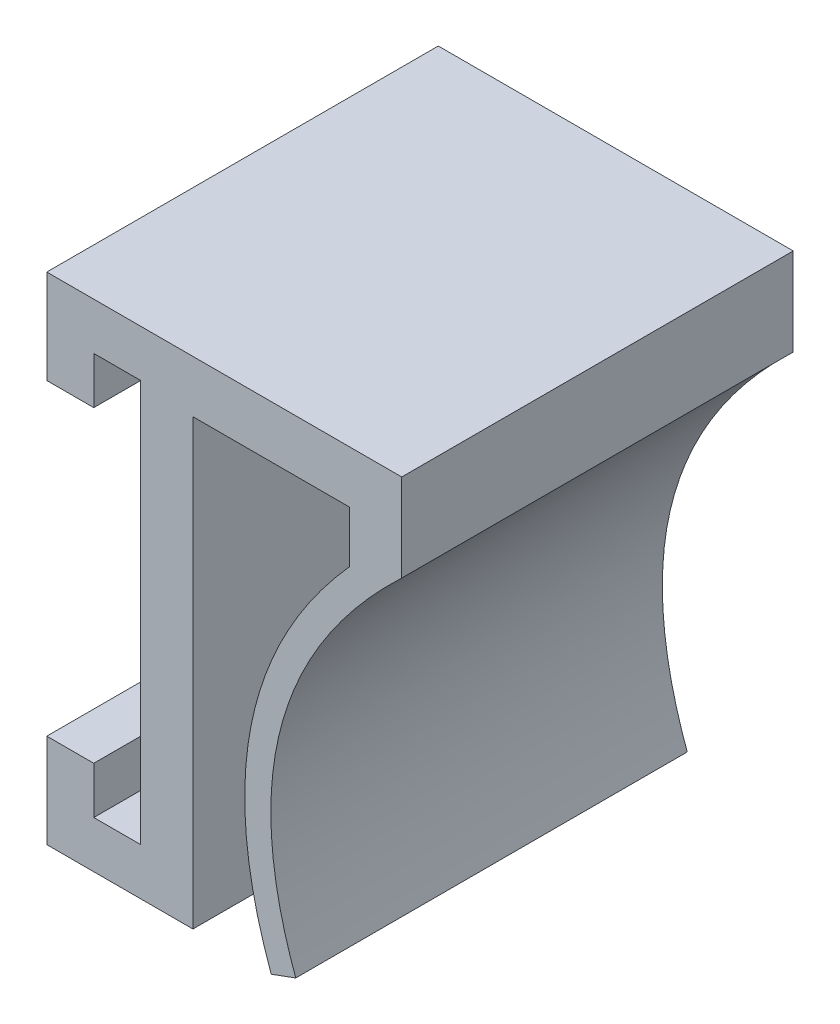
ISO-10303-21;
HEADER;
FILE_DESCRIPTION(('STEP AP214'),'2;1');
FILE_NAME('part.step','',(''),(''),'','','');
FILE_SCHEMA(('AUTOMOTIVE_DESIGN { 1 0 10303 214 1 1 1 1 }'));
ENDSEC;
DATA;
#1=APPLICATION_CONTEXT('core data for automotive mechanical design processes');
#2=APPLICATION_PROTOCOL_DEFINITION('international standard','automotive_design',2000,#1);
#3=PRODUCT_CONTEXT('',#1,'mechanical');
#4=PRODUCT('Part','Part','',(#3));
#5=PRODUCT_RELATED_PRODUCT_CATEGORY('part','',(#4));
#6=PRODUCT_DEFINITION_FORMATION('','',#4);
#7=PRODUCT_DEFINITION_CONTEXT('part definition',#1,'design');
#8=PRODUCT_DEFINITION('design','',#6,#7);
#9=PRODUCT_DEFINITION_SHAPE('','',#8);
#10=(LENGTH_UNIT() NAMED_UNIT(*) SI_UNIT(.MILLI.,.METRE.));
#11=(NAMED_UNIT(*) PLANE_ANGLE_UNIT() SI_UNIT($,.RADIAN.));
#12=(NAMED_UNIT(*) SI_UNIT($,.STERADIAN.) SOLID_ANGLE_UNIT());
#13=UNCERTAINTY_MEASURE_WITH_UNIT(LENGTH_MEASURE(1.E-05),#10,'distance_accuracy_value','');
#14=(GEOMETRIC_REPRESENTATION_CONTEXT(3) GLOBAL_UNCERTAINTY_ASSIGNED_CONTEXT((#13)) GLOBAL_UNIT_ASSIGNED_CONTEXT((#10,
#11,#12)) REPRESENTATION_CONTEXT('',''));
#15=CARTESIAN_POINT('',(0.,0.,0.));
#16=DIRECTION('',(0.,0.,1.));
#17=DIRECTION('',(1.,0.,0.));
#18=AXIS2_PLACEMENT_3D('',#15,#16,#17);
#19=CARTESIAN_POINT('',(-4.6,7.7,0.));
#20=DIRECTION('',(0.,1.,0.));
#21=DIRECTION('',(0.,0.,1.));
#22=AXIS2_PLACEMENT_3D('',#19,#20,#21);
#23=PLANE('',#22);
#24=DIRECTION('',(0.,0.,1.));
#25=VECTOR('',#24,1.);
#26=CARTESIAN_POINT('',(-2.8,7.7,0.));
#27=LINE('',#26,#25);
#28=CARTESIAN_POINT('',(-2.8,7.7,0.));
#29=VERTEX_POINT('',#28);
#30=CARTESIAN_POINT('',(-2.8,7.7,15.));
#31=VERTEX_POINT('',#30);
#32=EDGE_CURVE('E191',#29,#31,#27,.T.);
#33=ORIENTED_EDGE('',*,*,#32,.F.);
#34=DIRECTION('',(1.,0.,0.));
#35=VECTOR('',#34,1.);
#36=CARTESIAN_POINT('',(-4.6,7.7,0.));
#37=LINE('',#36,#35);
#38=CARTESIAN_POINT('',(-1.,7.7,0.));
#39=VERTEX_POINT('',#38);
#40=EDGE_CURVE('E39',#29,#39,#37,.T.);
#41=ORIENTED_EDGE('',*,*,#40,.T.);
#42=DIRECTION('',(0.,0.,1.));
#43=VECTOR('',#42,1.);
#44=CARTESIAN_POINT('',(-1.,7.7,0.));
#45=LINE('',#44,#43);
#46=CARTESIAN_POINT('',(-1.,7.7,15.));
#47=VERTEX_POINT('',#46);
#48=EDGE_CURVE('E176',#39,#47,#45,.T.);
#49=ORIENTED_EDGE('',*,*,#48,.T.);
#50=DIRECTION('',(1.,0.,0.));
#51=VECTOR('',#50,1.);
#52=CARTESIAN_POINT('',(-4.6,7.7,15.));
#53=LINE('',#52,#51);
#54=EDGE_CURVE('E232',#31,#47,#53,.T.);
#55=ORIENTED_EDGE('',*,*,#54,.F.);
#56=EDGE_LOOP('',(#33,#41,#49,#55));
#57=FACE_BOUND('',#56,.T.);
#58=ADVANCED_FACE('F35',(#57),#23,.F.);
#59=CARTESIAN_POINT('',(-4.6,-7.7,15.));
#60=DIRECTION('',(0.,-1.,0.));
#61=DIRECTION('',(0.,0.,-1.));
#62=AXIS2_PLACEMENT_3D('',#59,#60,#61);
#63=PLANE('',#62);
#64=DIRECTION('',(0.,0.,-1.));
#65=VECTOR('',#64,1.);
#66=CARTESIAN_POINT('',(-2.8,-7.7,15.));
#67=LINE('',#66,#65);
#68=CARTESIAN_POINT('',(-2.8,-7.7,15.));
#69=VERTEX_POINT('',#68);
#70=CARTESIAN_POINT('',(-2.8,-7.7,0.));
#71=VERTEX_POINT('',#70);
#72=EDGE_CURVE('E201',#69,#71,#67,.T.);
#73=ORIENTED_EDGE('',*,*,#72,.F.);
#74=DIRECTION('',(1.,0.,0.));
#75=VECTOR('',#74,1.);
#76=CARTESIAN_POINT('',(-4.6,-7.7,15.));
#77=LINE('',#76,#75);
#78=CARTESIAN_POINT('',(-1.,-7.7,15.));
#79=VERTEX_POINT('',#78);
#80=EDGE_CURVE('E228',#69,#79,#77,.T.);
#81=ORIENTED_EDGE('',*,*,#80,.T.);
#82=DIRECTION('',(0.,0.,-1.));
#83=VECTOR('',#82,1.);
#84=CARTESIAN_POINT('',(-1.,-7.7,15.));
#85=LINE('',#84,#83);
#86=CARTESIAN_POINT('',(-1.,-7.7,0.));
#87=VERTEX_POINT('',#86);
#88=EDGE_CURVE('E217',#79,#87,#85,.T.);
#89=ORIENTED_EDGE('',*,*,#88,.T.);
#90=DIRECTION('',(1.,0.,0.));
#91=VECTOR('',#90,1.);
#92=CARTESIAN_POINT('',(-4.6,-7.7,0.));
#93=LINE('',#92,#91);
#94=EDGE_CURVE('E53',#71,#87,#93,.T.);
#95=ORIENTED_EDGE('',*,*,#94,.F.);
#96=EDGE_LOOP('',(#73,#81,#89,#95));
#97=FACE_BOUND('',#96,.T.);
#98=ADVANCED_FACE('F357',(#97),#63,.F.);
#99=CARTESIAN_POINT('',(-1.,0.,15.));
#100=DIRECTION('',(-1.,0.,0.));
#101=DIRECTION('',(0.,0.,1.));
#102=AXIS2_PLACEMENT_3D('',#99,#100,#101);
#103=PLANE('',#102);
#104=DIRECTION('',(0.,1.,0.));
#105=VECTOR('',#104,1.);
#106=CARTESIAN_POINT('',(-1.,0.,0.));
#107=LINE('',#106,#105);
#108=EDGE_CURVE('E249',#87,#39,#107,.T.);
#109=ORIENTED_EDGE('',*,*,#108,.F.);
#110=ORIENTED_EDGE('',*,*,#88,.F.);
#111=DIRECTION('',(0.,1.,0.));
#112=VECTOR('',#111,1.);
#113=CARTESIAN_POINT('',(-1.,0.,15.));
#114=LINE('',#113,#112);
#115=EDGE_CURVE('E244',#79,#47,#114,.T.);
#116=ORIENTED_EDGE('',*,*,#115,.T.);
#117=ORIENTED_EDGE('',*,*,#48,.F.);
#118=EDGE_LOOP('',(#109,#110,#116,#117));
#119=FACE_BOUND('',#118,.T.);
#120=ADVANCED_FACE('F354',(#119),#103,.T.);
#121=CARTESIAN_POINT('',(7.00000000000002,0.,15.));
#122=DIRECTION('',(1.,0.,0.));
#123=DIRECTION('',(0.,1.,0.));
#124=AXIS2_PLACEMENT_3D('',#121,#122,#123);
#125=PLANE('',#124);
#126=DIRECTION('',(0.,-1.,0.));
#127=VECTOR('',#126,1.);
#128=CARTESIAN_POINT('',(7.00000000000002,0.,0.));
#129=LINE('',#128,#127);
#130=CARTESIAN_POINT('',(7.,7.5,0.));
#131=VERTEX_POINT('',#130);
#132=CARTESIAN_POINT('',(7.00000000000001,5.52299375520584,0.));
#133=VERTEX_POINT('',#132);
#134=EDGE_CURVE('E261',#131,#133,#129,.T.);
#135=ORIENTED_EDGE('',*,*,#134,.T.);
#136=DIRECTION('',(0.,0.,-1.));
#137=VECTOR('',#136,1.);
#138=CARTESIAN_POINT('',(7.00000000000001,5.52299375520584,15.));
#139=LINE('',#138,#137);
#140=CARTESIAN_POINT('',(7.00000000000001,5.52299375520584,15.));
#141=VERTEX_POINT('',#140);
#142=EDGE_CURVE('E11',#141,#133,#139,.T.);
#143=ORIENTED_EDGE('',*,*,#142,.F.);
#144=DIRECTION('',(0.,-1.,0.));
#145=VECTOR('',#144,1.);
#146=CARTESIAN_POINT('',(7.00000000000002,0.,15.));
#147=LINE('',#146,#145);
#148=CARTESIAN_POINT('',(7.,7.5,15.));
#149=VERTEX_POINT('',#148);
#150=EDGE_CURVE('E235',#149,#141,#147,.T.);
#151=ORIENTED_EDGE('',*,*,#150,.F.);
#152=DIRECTION('',(0.,0.,-1.));
#153=VECTOR('',#152,1.);
#154=CARTESIAN_POINT('',(7.,7.5,15.));
#155=LINE('',#154,#153);
#156=EDGE_CURVE('E260',#149,#131,#155,.T.);
#157=ORIENTED_EDGE('',*,*,#156,.T.);
#158=EDGE_LOOP('',(#135,#143,#151,#157));
#159=FACE_BOUND('',#158,.T.);
#160=ADVANCED_FACE('F37',(#159),#125,.F.);
#161=CARTESIAN_POINT('',(9.,7.5,15.));
#162=CARTESIAN_POINT('',(0.513671397604281,0.00972507198340424,15.));
#163=CARTESIAN_POINT('',(4.,-9.5,15.));
#164=B_SPLINE_CURVE_WITH_KNOTS('',2,(#161,#162,#163),.UNSPECIFIED.,.F.,.F.,(3,3),(0.,1.),.UNSPECIFIED.);
#165=DIRECTION('',(0.,0.,-1.));
#166=VECTOR('',#165,1.);
#167=SURFACE_OF_LINEAR_EXTRUSION('',#164,#166);
#168=CARTESIAN_POINT('',(9.,7.5,0.));
#169=CARTESIAN_POINT('',(0.513671397604281,0.00972507198340424,0.));
#170=CARTESIAN_POINT('',(4.,-9.5,0.));
#171=B_SPLINE_CURVE_WITH_KNOTS('',2,(#168,#169,#170),.UNSPECIFIED.,.F.,.F.,(3,3),(0.,1.),.UNSPECIFIED.);
#172=CARTESIAN_POINT('',(4.,-9.5,0.));
#173=VERTEX_POINT('',#172);
#174=EDGE_CURVE('E264',#133,#173,#171,.T.);
#175=ORIENTED_EDGE('',*,*,#174,.T.);
#176=DIRECTION('',(0.,0.,-1.));
#177=VECTOR('',#176,1.);
#178=CARTESIAN_POINT('',(4.,-9.5,15.));
#179=LINE('',#178,#177);
#180=CARTESIAN_POINT('',(4.,-9.5,15.));
#181=VERTEX_POINT('',#180);
#182=EDGE_CURVE('E45',#181,#173,#179,.T.);
#183=ORIENTED_EDGE('',*,*,#182,.F.);
#184=EDGE_CURVE('E330',#141,#181,#164,.T.);
#185=ORIENTED_EDGE('',*,*,#184,.F.);
#186=ORIENTED_EDGE('',*,*,#142,.T.);
#187=EDGE_LOOP('',(#175,#183,#185,#186));
#188=FACE_BOUND('',#187,.T.);
#189=ADVANCED_FACE('F316',(#188),#167,.F.);
#190=CARTESIAN_POINT('',(3.5440440146482,-9.66715650359321,15.));
#191=DIRECTION('',(0.344204990556941,-0.938894522550694,0.));
#192=DIRECTION('',(0.938894522550694,0.344204990556941,0.));
#193=AXIS2_PLACEMENT_3D('',#190,#191,#192);
#194=PLANE('',#193);
#195=DIRECTION('',(-0.938894522550694,-0.344204990556941,0.));
#196=VECTOR('',#195,1.);
#197=CARTESIAN_POINT('',(3.5440440146482,-9.66715650359321,0.));
#198=LINE('',#197,#196);
#199=CARTESIAN_POINT('',(4.93889452255069,-9.15579500944306,0.));
#200=VERTEX_POINT('',#199);
#201=EDGE_CURVE('E269',#200,#173,#198,.T.);
#202=ORIENTED_EDGE('',*,*,#201,.F.);
#203=DIRECTION('',(0.,0.,-1.));
#204=VECTOR('',#203,1.);
#205=CARTESIAN_POINT('',(4.93889452255069,-9.15579500944306,15.));
#206=LINE('',#205,#204);
#207=CARTESIAN_POINT('',(4.93889452255069,-9.15579500944306,15.));
#208=VERTEX_POINT('',#207);
#209=EDGE_CURVE('E307',#208,#200,#206,.T.);
#210=ORIENTED_EDGE('',*,*,#209,.F.);
#211=DIRECTION('',(-0.938894522550694,-0.344204990556941,0.));
#212=VECTOR('',#211,1.);
#213=CARTESIAN_POINT('',(3.5440440146482,-9.66715650359321,15.));
#214=LINE('',#213,#212);
#215=EDGE_CURVE('E314',#208,#181,#214,.T.);
#216=ORIENTED_EDGE('',*,*,#215,.T.);
#217=ORIENTED_EDGE('',*,*,#182,.T.);
#218=EDGE_LOOP('',(#202,#210,#216,#217));
#219=FACE_BOUND('',#218,.T.);
#220=ADVANCED_FACE('F312',(#219),#194,.T.);
#221=CARTESIAN_POINT('',(9.66164792995111,6.75036507703895,15.));
#222=CARTESIAN_POINT('',(9.32896777814482,6.4567280238455,15.));
#223=CARTESIAN_POINT('',(8.66804038057771,5.84179098884016,15.));
#224=CARTESIAN_POINT('',(7.50087633938905,4.62346960819315,15.));
#225=CARTESIAN_POINT('',(6.26715476381559,3.06778627060104,15.));
#226=CARTESIAN_POINT('',(5.15930956371234,1.16879441540626,15.));
#227=CARTESIAN_POINT('',(4.40809690818822,-0.769290789071615,15.));
#228=CARTESIAN_POINT('',(4.00515037648977,-2.75525930360367,15.));
#229=CARTESIAN_POINT('',(3.94541931842551,-4.80308361340073,15.));
#230=CARTESIAN_POINT('',(4.18652920951492,-6.57746866009865,15.));
#231=CARTESIAN_POINT('',(4.55459584435961,-8.0318757259233,15.));
#232=CARTESIAN_POINT('',(4.80398720771199,-8.78781362367087,15.));
#233=CARTESIAN_POINT('',(4.93889452255066,-9.15579500944297,15.));
#234=B_SPLINE_CURVE_WITH_KNOTS('',3,(#221,#222,#223,#224,#225,#226,#227,#228,#229,#230,#231,
#232,#233),.UNSPECIFIED.,.F.,.F.,(4,1,1,1,1,1,1,1,1,1,4),(0.,0.0625,0.125,0.25,0.375,0.5,0.625,
0.75,0.875,0.9375,1.),.UNSPECIFIED.);
#235=DIRECTION('',(0.,0.,-1.));
#236=VECTOR('',#235,1.);
#237=SURFACE_OF_LINEAR_EXTRUSION('',#234,#236);
#238=CARTESIAN_POINT('',(9.66164792995111,6.75036507703895,0.));
#239=CARTESIAN_POINT('',(9.32896777814482,6.4567280238455,0.));
#240=CARTESIAN_POINT('',(8.66804038057771,5.84179098884016,0.));
#241=CARTESIAN_POINT('',(7.50087633938905,4.62346960819315,0.));
#242=CARTESIAN_POINT('',(6.26715476381559,3.06778627060104,0.));
#243=CARTESIAN_POINT('',(5.15930956371234,1.16879441540626,0.));
#244=CARTESIAN_POINT('',(4.40809690818822,-0.769290789071615,0.));
#245=CARTESIAN_POINT('',(4.00515037648977,-2.75525930360367,0.));
#246=CARTESIAN_POINT('',(3.94541931842551,-4.80308361340073,0.));
#247=CARTESIAN_POINT('',(4.18652920951492,-6.57746866009865,0.));
#248=CARTESIAN_POINT('',(4.55459584435961,-8.0318757259233,0.));
#249=CARTESIAN_POINT('',(4.80398720771199,-8.78781362367087,0.));
#250=CARTESIAN_POINT('',(4.93889452255066,-9.15579500944297,0.));
#251=B_SPLINE_CURVE_WITH_KNOTS('',3,(#238,#239,#240,#241,#242,#243,#244,#245,#246,#247,#248,
#249,#250),.UNSPECIFIED.,.F.,.F.,(4,1,1,1,1,1,1,1,1,1,4),(0.,0.0625,0.125,0.25,0.375,0.5,0.625,
0.75,0.875,0.9375,1.),.UNSPECIFIED.);
#252=CARTESIAN_POINT('',(9.,6.14508408209819,0.));
#253=VERTEX_POINT('',#252);
#254=EDGE_CURVE('E275',#253,#200,#251,.T.);
#255=ORIENTED_EDGE('',*,*,#254,.F.);
#256=DIRECTION('',(0.,0.,-1.));
#257=VECTOR('',#256,1.);
#258=CARTESIAN_POINT('',(9.,6.14508408209819,15.));
#259=LINE('',#258,#257);
#260=CARTESIAN_POINT('',(9.,6.14508408209819,15.));
#261=VERTEX_POINT('',#260);
#262=EDGE_CURVE('E305',#261,#253,#259,.T.);
#263=ORIENTED_EDGE('',*,*,#262,.F.);
#264=EDGE_CURVE('E324',#261,#208,#234,.T.);
#265=ORIENTED_EDGE('',*,*,#264,.T.);
#266=ORIENTED_EDGE('',*,*,#209,.T.);
#267=EDGE_LOOP('',(#255,#263,#265,#266));
#268=FACE_BOUND('',#267,.T.);
#269=ADVANCED_FACE('F321',(#268),#237,.T.);
#270=CARTESIAN_POINT('',(9.,0.,15.));
#271=DIRECTION('',(1.,0.,0.));
#272=DIRECTION('',(0.,0.,-1.));
#273=AXIS2_PLACEMENT_3D('',#270,#271,#272);
#274=PLANE('',#273);
#275=DIRECTION('',(0.,-1.,0.));
#276=VECTOR('',#275,1.);
#277=CARTESIAN_POINT('',(9.,0.,0.));
#278=LINE('',#277,#276);
#279=CARTESIAN_POINT('',(9.,9.50000000000002,0.));
#280=VERTEX_POINT('',#279);
#281=EDGE_CURVE('E280',#280,#253,#278,.T.);
#282=ORIENTED_EDGE('',*,*,#281,.F.);
#283=DIRECTION('',(0.,0.,-1.));
#284=VECTOR('',#283,1.);
#285=CARTESIAN_POINT('',(9.,9.50000000000002,15.));
#286=LINE('',#285,#284);
#287=CARTESIAN_POINT('',(9.,9.50000000000002,15.));
#288=VERTEX_POINT('',#287);
#289=EDGE_CURVE('E303',#288,#280,#286,.T.);
#290=ORIENTED_EDGE('',*,*,#289,.F.);
#291=DIRECTION('',(0.,-1.,0.));
#292=VECTOR('',#291,1.);
#293=CARTESIAN_POINT('',(9.,0.,15.));
#294=LINE('',#293,#292);
#295=EDGE_CURVE('E332',#288,#261,#294,.T.);
#296=ORIENTED_EDGE('',*,*,#295,.T.);
#297=ORIENTED_EDGE('',*,*,#262,.T.);
#298=EDGE_LOOP('',(#282,#290,#296,#297));
#299=FACE_BOUND('',#298,.T.);
#300=ADVANCED_FACE('F347',(#299),#274,.T.);
#301=CARTESIAN_POINT('',(0.,9.5,15.));
#302=DIRECTION('',(0.,1.,0.));
#303=DIRECTION('',(-1.,0.,0.));
#304=AXIS2_PLACEMENT_3D('',#301,#302,#303);
#305=PLANE('',#304);
#306=DIRECTION('',(1.,0.,0.));
#307=VECTOR('',#306,1.);
#308=CARTESIAN_POINT('',(0.,9.5,0.));
#309=LINE('',#308,#307);
#310=CARTESIAN_POINT('',(-4.6,9.5,0.));
#311=VERTEX_POINT('',#310);
#312=EDGE_CURVE('E286',#311,#280,#309,.T.);
#313=ORIENTED_EDGE('',*,*,#312,.F.);
#314=DIRECTION('',(0.,0.,-1.));
#315=VECTOR('',#314,1.);
#316=CARTESIAN_POINT('',(-4.6,9.5,0.));
#317=LINE('',#316,#315);
#318=CARTESIAN_POINT('',(-4.6,9.5,15.));
#319=VERTEX_POINT('',#318);
#320=EDGE_CURVE('E173',#319,#311,#317,.T.);
#321=ORIENTED_EDGE('',*,*,#320,.F.);
#322=DIRECTION('',(1.,0.,0.));
#323=VECTOR('',#322,1.);
#324=CARTESIAN_POINT('',(0.,9.5,15.));
#325=LINE('',#324,#323);
#326=EDGE_CURVE('E248',#319,#288,#325,.T.);
#327=ORIENTED_EDGE('',*,*,#326,.T.);
#328=ORIENTED_EDGE('',*,*,#289,.T.);
#329=EDGE_LOOP('',(#313,#321,#327,#328));
#330=FACE_BOUND('',#329,.T.);
#331=ADVANCED_FACE('F381',(#330),#305,.T.);
#332=CARTESIAN_POINT('',(0.,-9.5,15.));
#333=DIRECTION('',(0.,1.,0.));
#334=DIRECTION('',(0.,0.,1.));
#335=AXIS2_PLACEMENT_3D('',#332,#333,#334);
#336=PLANE('',#335);
#337=DIRECTION('',(1.,0.,0.));
#338=VECTOR('',#337,1.);
#339=CARTESIAN_POINT('',(0.,-9.5,0.));
#340=LINE('',#339,#338);
#341=CARTESIAN_POINT('',(-4.6,-9.5,0.));
#342=VERTEX_POINT('',#341);
#343=CARTESIAN_POINT('',(1.,-9.5,0.));
#344=VERTEX_POINT('',#343);
#345=EDGE_CURVE('E289',#342,#344,#340,.T.);
#346=ORIENTED_EDGE('',*,*,#345,.T.);
#347=DIRECTION('',(0.,0.,-1.));
#348=VECTOR('',#347,1.);
#349=CARTESIAN_POINT('',(1.,-9.5,15.));
#350=LINE('',#349,#348);
#351=CARTESIAN_POINT('',(1.,-9.5,15.));
#352=VERTEX_POINT('',#351);
#353=EDGE_CURVE('E300',#352,#344,#350,.T.);
#354=ORIENTED_EDGE('',*,*,#353,.F.);
#355=DIRECTION('',(1.,0.,0.));
#356=VECTOR('',#355,1.);
#357=CARTESIAN_POINT('',(0.,-9.5,15.));
#358=LINE('',#357,#356);
#359=CARTESIAN_POINT('',(-4.6,-9.5,15.));
#360=VERTEX_POINT('',#359);
#361=EDGE_CURVE('E247',#360,#352,#358,.T.);
#362=ORIENTED_EDGE('',*,*,#361,.F.);
#363=DIRECTION('',(0.,0.,1.));
#364=VECTOR('',#363,1.);
#365=CARTESIAN_POINT('',(-4.6,-9.5,15.));
#366=LINE('',#365,#364);
#367=EDGE_CURVE('E223',#342,#360,#366,.T.);
#368=ORIENTED_EDGE('',*,*,#367,.F.);
#369=EDGE_LOOP('',(#346,#354,#362,#368));
#370=FACE_BOUND('',#369,.T.);
#371=ADVANCED_FACE('F377',(#370),#336,.F.);
#372=CARTESIAN_POINT('',(1.,0.,15.));
#373=DIRECTION('',(-1.,0.,0.));
#374=DIRECTION('',(0.,-1.,0.));
#375=AXIS2_PLACEMENT_3D('',#372,#373,#374);
#376=PLANE('',#375);
#377=DIRECTION('',(0.,1.,0.));
#378=VECTOR('',#377,1.);
#379=CARTESIAN_POINT('',(1.,0.,0.));
#380=LINE('',#379,#378);
#381=CARTESIAN_POINT('',(1.,7.5,0.));
#382=VERTEX_POINT('',#381);
#383=EDGE_CURVE('E291',#344,#382,#380,.T.);
#384=ORIENTED_EDGE('',*,*,#383,.T.);
#385=DIRECTION('',(0.,0.,-1.));
#386=VECTOR('',#385,1.);
#387=CARTESIAN_POINT('',(1.,7.5,15.));
#388=LINE('',#387,#386);
#389=CARTESIAN_POINT('',(1.,7.5,15.));
#390=VERTEX_POINT('',#389);
#391=EDGE_CURVE('E297',#390,#382,#388,.T.);
#392=ORIENTED_EDGE('',*,*,#391,.F.);
#393=DIRECTION('',(0.,1.,0.));
#394=VECTOR('',#393,1.);
#395=CARTESIAN_POINT('',(1.,0.,15.));
#396=LINE('',#395,#394);
#397=EDGE_CURVE('E256',#352,#390,#396,.T.);
#398=ORIENTED_EDGE('',*,*,#397,.F.);
#399=ORIENTED_EDGE('',*,*,#353,.T.);
#400=EDGE_LOOP('',(#384,#392,#398,#399));
#401=FACE_BOUND('',#400,.T.);
#402=ADVANCED_FACE('F373',(#401),#376,.F.);
#403=CARTESIAN_POINT('',(0.,7.5,15.));
#404=DIRECTION('',(0.,1.,0.));
#405=DIRECTION('',(-1.,0.,0.));
#406=AXIS2_PLACEMENT_3D('',#403,#404,#405);
#407=PLANE('',#406);
#408=DIRECTION('',(1.,0.,0.));
#409=VECTOR('',#408,1.);
#410=CARTESIAN_POINT('',(0.,7.5,0.));
#411=LINE('',#410,#409);
#412=EDGE_CURVE('E293',#382,#131,#411,.T.);
#413=ORIENTED_EDGE('',*,*,#412,.T.);
#414=ORIENTED_EDGE('',*,*,#156,.F.);
#415=DIRECTION('',(1.,0.,0.));
#416=VECTOR('',#415,1.);
#417=CARTESIAN_POINT('',(0.,7.5,15.));
#418=LINE('',#417,#416);
#419=EDGE_CURVE('E258',#390,#149,#418,.T.);
#420=ORIENTED_EDGE('',*,*,#419,.F.);
#421=ORIENTED_EDGE('',*,*,#391,.T.);
#422=EDGE_LOOP('',(#413,#414,#420,#421));
#423=FACE_BOUND('',#422,.T.);
#424=ADVANCED_FACE('F368',(#423),#407,.F.);
#425=CARTESIAN_POINT('',(0.,0.,15.));
#426=DIRECTION('',(0.,0.,1.));
#427=DIRECTION('',(1.,0.,0.));
#428=AXIS2_PLACEMENT_3D('',#425,#426,#427);
#429=PLANE('',#428);
#430=ORIENTED_EDGE('',*,*,#150,.T.);
#431=ORIENTED_EDGE('',*,*,#184,.T.);
#432=ORIENTED_EDGE('',*,*,#215,.F.);
#433=ORIENTED_EDGE('',*,*,#264,.F.);
#434=ORIENTED_EDGE('',*,*,#295,.F.);
#435=ORIENTED_EDGE('',*,*,#326,.F.);
#436=DIRECTION('',(0.,1.,0.));
#437=VECTOR('',#436,1.);
#438=CARTESIAN_POINT('',(-4.6,9.5,15.));
#439=LINE('',#438,#437);
#440=CARTESIAN_POINT('',(-4.6,5.9,15.));
#441=VERTEX_POINT('',#440);
#442=EDGE_CURVE('E175',#441,#319,#439,.T.);
#443=ORIENTED_EDGE('',*,*,#442,.F.);
#444=DIRECTION('',(-1.,0.,0.));
#445=VECTOR('',#444,1.);
#446=CARTESIAN_POINT('',(-4.6,5.9,15.));
#447=LINE('',#446,#445);
#448=CARTESIAN_POINT('',(-2.8,5.9,15.));
#449=VERTEX_POINT('',#448);
#450=EDGE_CURVE('E190',#449,#441,#447,.T.);
#451=ORIENTED_EDGE('',*,*,#450,.F.);
#452=DIRECTION('',(0.,1.,0.));
#453=VECTOR('',#452,1.);
#454=CARTESIAN_POINT('',(-2.8,5.9,15.));
#455=LINE('',#454,#453);
#456=EDGE_CURVE('E196',#449,#31,#455,.T.);
#457=ORIENTED_EDGE('',*,*,#456,.T.);
#458=ORIENTED_EDGE('',*,*,#54,.T.);
#459=ORIENTED_EDGE('',*,*,#115,.F.);
#460=ORIENTED_EDGE('',*,*,#80,.F.);
#461=DIRECTION('',(0.,-1.,0.));
#462=VECTOR('',#461,1.);
#463=CARTESIAN_POINT('',(-2.8,-5.9,15.));
#464=LINE('',#463,#462);
#465=CARTESIAN_POINT('',(-2.8,-5.9,15.));
#466=VERTEX_POINT('',#465);
#467=EDGE_CURVE('E215',#466,#69,#464,.T.);
#468=ORIENTED_EDGE('',*,*,#467,.F.);
#469=DIRECTION('',(1.,0.,0.));
#470=VECTOR('',#469,1.);
#471=CARTESIAN_POINT('',(-4.6,-5.9,15.));
#472=LINE('',#471,#470);
#473=CARTESIAN_POINT('',(-4.6,-5.9,15.));
#474=VERTEX_POINT('',#473);
#475=EDGE_CURVE('E205',#474,#466,#472,.T.);
#476=ORIENTED_EDGE('',*,*,#475,.F.);
#477=DIRECTION('',(0.,1.,0.));
#478=VECTOR('',#477,1.);
#479=CARTESIAN_POINT('',(-4.6,-9.5,15.));
#480=LINE('',#479,#478);
#481=EDGE_CURVE('E218',#360,#474,#480,.T.);
#482=ORIENTED_EDGE('',*,*,#481,.F.);
#483=ORIENTED_EDGE('',*,*,#361,.T.);
#484=ORIENTED_EDGE('',*,*,#397,.T.);
#485=ORIENTED_EDGE('',*,*,#419,.T.);
#486=EDGE_LOOP('',(#430,#431,#432,#433,#434,#435,#443,#451,#457,#458,#459,#460,#468,#476,#482,
#483,#484,#485));
#487=FACE_BOUND('',#486,.T.);
#488=ADVANCED_FACE('F327',(#487),#429,.T.);
#489=CARTESIAN_POINT('',(0.,0.,0.));
#490=DIRECTION('',(0.,0.,1.));
#491=DIRECTION('',(1.,0.,0.));
#492=AXIS2_PLACEMENT_3D('',#489,#490,#491);
#493=PLANE('',#492);
#494=ORIENTED_EDGE('',*,*,#134,.F.);
#495=ORIENTED_EDGE('',*,*,#412,.F.);
#496=ORIENTED_EDGE('',*,*,#383,.F.);
#497=ORIENTED_EDGE('',*,*,#345,.F.);
#498=DIRECTION('',(0.,-1.,0.));
#499=VECTOR('',#498,1.);
#500=CARTESIAN_POINT('',(-4.6,-9.5,0.));
#501=LINE('',#500,#499);
#502=CARTESIAN_POINT('',(-4.6,-5.9,0.));
#503=VERTEX_POINT('',#502);
#504=EDGE_CURVE('E220',#503,#342,#501,.T.);
#505=ORIENTED_EDGE('',*,*,#504,.F.);
#506=DIRECTION('',(-1.,0.,0.));
#507=VECTOR('',#506,1.);
#508=CARTESIAN_POINT('',(-4.6,-5.9,0.));
#509=LINE('',#508,#507);
#510=CARTESIAN_POINT('',(-2.8,-5.9,0.));
#511=VERTEX_POINT('',#510);
#512=EDGE_CURVE('E209',#511,#503,#509,.T.);
#513=ORIENTED_EDGE('',*,*,#512,.F.);
#514=DIRECTION('',(0.,-1.,0.));
#515=VECTOR('',#514,1.);
#516=CARTESIAN_POINT('',(-2.8,-5.9,0.));
#517=LINE('',#516,#515);
#518=EDGE_CURVE('E212',#511,#71,#517,.T.);
#519=ORIENTED_EDGE('',*,*,#518,.T.);
#520=ORIENTED_EDGE('',*,*,#94,.T.);
#521=ORIENTED_EDGE('',*,*,#108,.T.);
#522=ORIENTED_EDGE('',*,*,#40,.F.);
#523=DIRECTION('',(0.,1.,0.));
#524=VECTOR('',#523,1.);
#525=CARTESIAN_POINT('',(-2.8,5.9,0.));
#526=LINE('',#525,#524);
#527=CARTESIAN_POINT('',(-2.8,5.9,0.));
#528=VERTEX_POINT('',#527);
#529=EDGE_CURVE('E182',#528,#29,#526,.T.);
#530=ORIENTED_EDGE('',*,*,#529,.F.);
#531=DIRECTION('',(1.,0.,0.));
#532=VECTOR('',#531,1.);
#533=CARTESIAN_POINT('',(-4.6,5.9,0.));
#534=LINE('',#533,#532);
#535=CARTESIAN_POINT('',(-4.6,5.9,0.));
#536=VERTEX_POINT('',#535);
#537=EDGE_CURVE('E179',#536,#528,#534,.T.);
#538=ORIENTED_EDGE('',*,*,#537,.F.);
#539=DIRECTION('',(0.,-1.,0.));
#540=VECTOR('',#539,1.);
#541=CARTESIAN_POINT('',(-4.6,9.5,0.));
#542=LINE('',#541,#540);
#543=EDGE_CURVE('E166',#311,#536,#542,.T.);
#544=ORIENTED_EDGE('',*,*,#543,.F.);
#545=ORIENTED_EDGE('',*,*,#312,.T.);
#546=ORIENTED_EDGE('',*,*,#281,.T.);
#547=ORIENTED_EDGE('',*,*,#254,.T.);
#548=ORIENTED_EDGE('',*,*,#201,.T.);
#549=ORIENTED_EDGE('',*,*,#174,.F.);
#550=EDGE_LOOP('',(#494,#495,#496,#497,#505,#513,#519,#520,#521,#522,#530,#538,#544,#545,#546,
#547,#548,#549));
#551=FACE_BOUND('',#550,.T.);
#552=ADVANCED_FACE('F181',(#551),#493,.F.);
#553=CARTESIAN_POINT('',(-4.6,0.,0.));
#554=DIRECTION('',(-1.,0.,0.));
#555=DIRECTION('',(0.,0.,1.));
#556=AXIS2_PLACEMENT_3D('',#553,#554,#555);
#557=PLANE('',#556);
#558=ORIENTED_EDGE('',*,*,#543,.T.);
#559=DIRECTION('',(0.,0.,-1.));
#560=VECTOR('',#559,1.);
#561=CARTESIAN_POINT('',(-4.6,5.9,0.));
#562=LINE('',#561,#560);
#563=EDGE_CURVE('E171',#441,#536,#562,.T.);
#564=ORIENTED_EDGE('',*,*,#563,.F.);
#565=ORIENTED_EDGE('',*,*,#442,.T.);
#566=ORIENTED_EDGE('',*,*,#320,.T.);
#567=EDGE_LOOP('',(#558,#564,#565,#566));
#568=FACE_BOUND('',#567,.T.);
#569=ADVANCED_FACE('F168',(#568),#557,.T.);
#570=CARTESIAN_POINT('',(-4.6,0.,0.));
#571=DIRECTION('',(-1.,0.,0.));
#572=DIRECTION('',(0.,0.,1.));
#573=AXIS2_PLACEMENT_3D('',#570,#571,#572);
#574=PLANE('',#573);
#575=ORIENTED_EDGE('',*,*,#481,.T.);
#576=DIRECTION('',(0.,0.,1.));
#577=VECTOR('',#576,1.);
#578=CARTESIAN_POINT('',(-4.6,-5.9,15.));
#579=LINE('',#578,#577);
#580=EDGE_CURVE('E202',#503,#474,#579,.T.);
#581=ORIENTED_EDGE('',*,*,#580,.F.);
#582=ORIENTED_EDGE('',*,*,#504,.T.);
#583=ORIENTED_EDGE('',*,*,#367,.T.);
#584=EDGE_LOOP('',(#575,#581,#582,#583));
#585=FACE_BOUND('',#584,.T.);
#586=ADVANCED_FACE('F412',(#585),#574,.T.);
#587=CARTESIAN_POINT('',(-2.8,-5.9,15.));
#588=DIRECTION('',(-1.,0.,0.));
#589=DIRECTION('',(0.,0.,1.));
#590=AXIS2_PLACEMENT_3D('',#587,#588,#589);
#591=PLANE('',#590);
#592=ORIENTED_EDGE('',*,*,#72,.T.);
#593=ORIENTED_EDGE('',*,*,#518,.F.);
#594=DIRECTION('',(0.,0.,-1.));
#595=VECTOR('',#594,1.);
#596=CARTESIAN_POINT('',(-2.8,-5.9,15.));
#597=LINE('',#596,#595);
#598=EDGE_CURVE('E207',#466,#511,#597,.T.);
#599=ORIENTED_EDGE('',*,*,#598,.F.);
#600=ORIENTED_EDGE('',*,*,#467,.T.);
#601=EDGE_LOOP('',(#592,#593,#599,#600));
#602=FACE_BOUND('',#601,.T.);
#603=ADVANCED_FACE('F406',(#602),#591,.F.);
#604=CARTESIAN_POINT('',(0.,-5.9,0.));
#605=DIRECTION('',(0.,-1.,0.));
#606=DIRECTION('',(0.,0.,-1.));
#607=AXIS2_PLACEMENT_3D('',#604,#605,#606);
#608=PLANE('',#607);
#609=ORIENTED_EDGE('',*,*,#580,.T.);
#610=ORIENTED_EDGE('',*,*,#475,.T.);
#611=ORIENTED_EDGE('',*,*,#598,.T.);
#612=ORIENTED_EDGE('',*,*,#512,.T.);
#613=EDGE_LOOP('',(#609,#610,#611,#612));
#614=FACE_BOUND('',#613,.T.);
#615=ADVANCED_FACE('F410',(#614),#608,.F.);
#616=CARTESIAN_POINT('',(-2.8,5.9,0.));
#617=DIRECTION('',(-1.,0.,0.));
#618=DIRECTION('',(0.,0.,1.));
#619=AXIS2_PLACEMENT_3D('',#616,#617,#618);
#620=PLANE('',#619);
#621=ORIENTED_EDGE('',*,*,#32,.T.);
#622=ORIENTED_EDGE('',*,*,#456,.F.);
#623=DIRECTION('',(0.,0.,1.));
#624=VECTOR('',#623,1.);
#625=CARTESIAN_POINT('',(-2.8,5.9,0.));
#626=LINE('',#625,#624);
#627=EDGE_CURVE('E185',#528,#449,#626,.T.);
#628=ORIENTED_EDGE('',*,*,#627,.F.);
#629=ORIENTED_EDGE('',*,*,#529,.T.);
#630=EDGE_LOOP('',(#621,#622,#628,#629));
#631=FACE_BOUND('',#630,.T.);
#632=ADVANCED_FACE('F433',(#631),#620,.F.);
#633=CARTESIAN_POINT('',(0.,5.9,0.));
#634=DIRECTION('',(0.,1.,0.));
#635=DIRECTION('',(0.,0.,1.));
#636=AXIS2_PLACEMENT_3D('',#633,#634,#635);
#637=PLANE('',#636);
#638=ORIENTED_EDGE('',*,*,#563,.T.);
#639=ORIENTED_EDGE('',*,*,#537,.T.);
#640=ORIENTED_EDGE('',*,*,#627,.T.);
#641=ORIENTED_EDGE('',*,*,#450,.T.);
#642=EDGE_LOOP('',(#638,#639,#640,#641));
#643=FACE_BOUND('',#642,.T.);
#644=ADVANCED_FACE('F188',(#643),#637,.F.);
#645=CLOSED_SHELL('',(#58,#98,#120,#160,#189,#220,#269,#300,#331,#371,#402,#424,#488,#552,#569,
#586,#603,#615,#632,#644));
#646=MANIFOLD_SOLID_BREP('B2',#645);
#647=ADVANCED_BREP_SHAPE_REPRESENTATION('',(#18,#646),#14);
#648=SHAPE_DEFINITION_REPRESENTATION(#9,#647);
ENDSEC;
END-ISO-10303-21;
